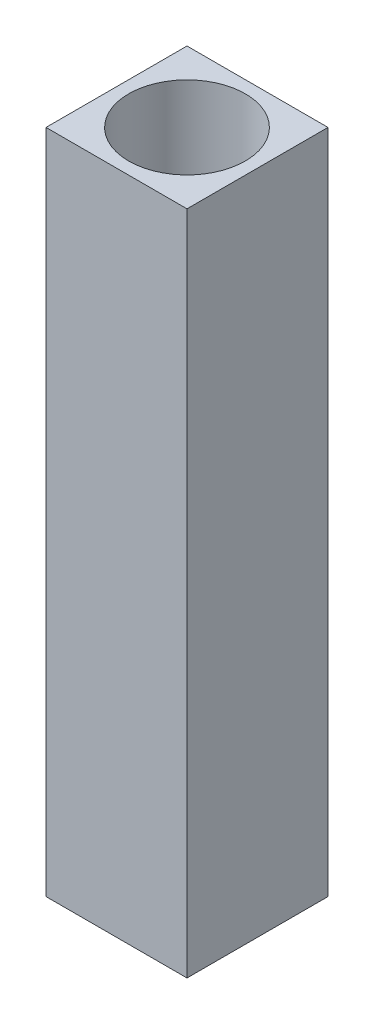
ISO-10303-21;
HEADER;
FILE_DESCRIPTION(('STEP AP214'),'2;1');
FILE_NAME('part.step','',(''),(''),'','','');
FILE_SCHEMA(('AUTOMOTIVE_DESIGN { 1 0 10303 214 1 1 1 1 }'));
ENDSEC;
DATA;
#1=APPLICATION_CONTEXT('core data for automotive mechanical design processes');
#2=APPLICATION_PROTOCOL_DEFINITION('international standard','automotive_design',2000,#1);
#3=PRODUCT_CONTEXT('',#1,'mechanical');
#4=PRODUCT('Part','Part','',(#3));
#5=PRODUCT_RELATED_PRODUCT_CATEGORY('part','',(#4));
#6=PRODUCT_DEFINITION_FORMATION('','',#4);
#7=PRODUCT_DEFINITION_CONTEXT('part definition',#1,'design');
#8=PRODUCT_DEFINITION('design','',#6,#7);
#9=PRODUCT_DEFINITION_SHAPE('','',#8);
#10=(LENGTH_UNIT() NAMED_UNIT(*) SI_UNIT(.MILLI.,.METRE.));
#11=(NAMED_UNIT(*) PLANE_ANGLE_UNIT() SI_UNIT($,.RADIAN.));
#12=(NAMED_UNIT(*) SI_UNIT($,.STERADIAN.) SOLID_ANGLE_UNIT());
#13=UNCERTAINTY_MEASURE_WITH_UNIT(LENGTH_MEASURE(1.E-05),#10,'distance_accuracy_value','');
#14=(GEOMETRIC_REPRESENTATION_CONTEXT(3) GLOBAL_UNCERTAINTY_ASSIGNED_CONTEXT((#13)) GLOBAL_UNIT_ASSIGNED_CONTEXT((#10,
#11,#12)) REPRESENTATION_CONTEXT('',''));
#15=CARTESIAN_POINT('',(0.,0.,0.));
#16=DIRECTION('',(0.,0.,1.));
#17=DIRECTION('',(1.,0.,0.));
#18=AXIS2_PLACEMENT_3D('',#15,#16,#17);
#19=CARTESIAN_POINT('',(-0.635,-4.,-0.635));
#20=DIRECTION('',(0.,0.,-1.));
#21=DIRECTION('',(-1.,0.,0.));
#22=AXIS2_PLACEMENT_3D('',#19,#20,#21);
#23=PLANE('',#22);
#24=DIRECTION('',(-1.,0.,0.));
#25=VECTOR('',#24,1.);
#26=CARTESIAN_POINT('',(-0.635,6.,-0.635));
#27=LINE('',#26,#25);
#28=CARTESIAN_POINT('',(-0.635,6.,-0.635));
#29=VERTEX_POINT('',#28);
#30=CARTESIAN_POINT('',(0.635,6.,-0.635));
#31=VERTEX_POINT('',#30);
#32=EDGE_CURVE('E72',#29,#31,#27,.F.);
#33=ORIENTED_EDGE('',*,*,#32,.T.);
#34=DIRECTION('',(0.,1.,0.));
#35=VECTOR('',#34,1.);
#36=CARTESIAN_POINT('',(0.635,-4.,-0.635));
#37=LINE('',#36,#35);
#38=CARTESIAN_POINT('',(0.635,0.,-0.635));
#39=VERTEX_POINT('',#38);
#40=EDGE_CURVE('E76',#39,#31,#37,.T.);
#41=ORIENTED_EDGE('',*,*,#40,.F.);
#42=DIRECTION('',(-1.,0.,0.));
#43=VECTOR('',#42,1.);
#44=CARTESIAN_POINT('',(-0.635,0.,-0.635));
#45=LINE('',#44,#43);
#46=CARTESIAN_POINT('',(-0.635,0.,-0.635));
#47=VERTEX_POINT('',#46);
#48=EDGE_CURVE('E82',#39,#47,#45,.T.);
#49=ORIENTED_EDGE('',*,*,#48,.T.);
#50=DIRECTION('',(0.,1.,0.));
#51=VECTOR('',#50,1.);
#52=CARTESIAN_POINT('',(-0.635,-4.,-0.635));
#53=LINE('',#52,#51);
#54=EDGE_CURVE('E74',#29,#47,#53,.F.);
#55=ORIENTED_EDGE('',*,*,#54,.F.);
#56=EDGE_LOOP('',(#33,#41,#49,#55));
#57=FACE_BOUND('',#56,.T.);
#58=ADVANCED_FACE('F17',(#57),#23,.T.);
#59=CARTESIAN_POINT('',(-0.635,-4.,0.635));
#60=DIRECTION('',(0.,0.,1.));
#61=DIRECTION('',(1.,0.,0.));
#62=AXIS2_PLACEMENT_3D('',#59,#60,#61);
#63=PLANE('',#62);
#64=DIRECTION('',(1.,0.,0.));
#65=VECTOR('',#64,1.);
#66=CARTESIAN_POINT('',(-0.635,6.,0.635));
#67=LINE('',#66,#65);
#68=CARTESIAN_POINT('',(0.635,6.,0.635));
#69=VERTEX_POINT('',#68);
#70=CARTESIAN_POINT('',(-0.635,6.,0.635));
#71=VERTEX_POINT('',#70);
#72=EDGE_CURVE('E33',#69,#71,#67,.F.);
#73=ORIENTED_EDGE('',*,*,#72,.T.);
#74=DIRECTION('',(0.,1.,0.));
#75=VECTOR('',#74,1.);
#76=CARTESIAN_POINT('',(-0.635,-4.,0.635));
#77=LINE('',#76,#75);
#78=CARTESIAN_POINT('',(-0.635,0.,0.635));
#79=VERTEX_POINT('',#78);
#80=EDGE_CURVE('E59',#79,#71,#77,.T.);
#81=ORIENTED_EDGE('',*,*,#80,.F.);
#82=DIRECTION('',(1.,0.,0.));
#83=VECTOR('',#82,1.);
#84=CARTESIAN_POINT('',(-0.635,0.,0.635));
#85=LINE('',#84,#83);
#86=CARTESIAN_POINT('',(0.635,0.,0.635));
#87=VERTEX_POINT('',#86);
#88=EDGE_CURVE('E64',#79,#87,#85,.T.);
#89=ORIENTED_EDGE('',*,*,#88,.T.);
#90=DIRECTION('',(0.,1.,0.));
#91=VECTOR('',#90,1.);
#92=CARTESIAN_POINT('',(0.635,-4.,0.635));
#93=LINE('',#92,#91);
#94=EDGE_CURVE('E62',#69,#87,#93,.F.);
#95=ORIENTED_EDGE('',*,*,#94,.F.);
#96=EDGE_LOOP('',(#73,#81,#89,#95));
#97=FACE_BOUND('',#96,.T.);
#98=ADVANCED_FACE('F58',(#97),#63,.T.);
#99=CARTESIAN_POINT('',(-0.635,-4.,-0.635));
#100=DIRECTION('',(-1.,0.,0.));
#101=DIRECTION('',(0.,0.,1.));
#102=AXIS2_PLACEMENT_3D('',#99,#100,#101);
#103=PLANE('',#102);
#104=DIRECTION('',(0.,0.,1.));
#105=VECTOR('',#104,1.);
#106=CARTESIAN_POINT('',(-0.635,6.,-0.635));
#107=LINE('',#106,#105);
#108=EDGE_CURVE('E54',#71,#29,#107,.F.);
#109=ORIENTED_EDGE('',*,*,#108,.T.);
#110=ORIENTED_EDGE('',*,*,#54,.T.);
#111=DIRECTION('',(0.,0.,1.));
#112=VECTOR('',#111,1.);
#113=CARTESIAN_POINT('',(-0.635,0.,1.385));
#114=LINE('',#113,#112);
#115=EDGE_CURVE('E68',#47,#79,#114,.T.);
#116=ORIENTED_EDGE('',*,*,#115,.T.);
#117=ORIENTED_EDGE('',*,*,#80,.T.);
#118=EDGE_LOOP('',(#109,#110,#116,#117));
#119=FACE_BOUND('',#118,.T.);
#120=ADVANCED_FACE('F66',(#119),#103,.T.);
#121=CARTESIAN_POINT('',(0.635,-4.,-0.635));
#122=DIRECTION('',(1.,0.,0.));
#123=DIRECTION('',(0.,0.,-1.));
#124=AXIS2_PLACEMENT_3D('',#121,#122,#123);
#125=PLANE('',#124);
#126=DIRECTION('',(0.,0.,1.));
#127=VECTOR('',#126,1.);
#128=CARTESIAN_POINT('',(0.635,6.,1.385));
#129=LINE('',#128,#127);
#130=EDGE_CURVE('E91',#69,#31,#129,.F.);
#131=ORIENTED_EDGE('',*,*,#130,.F.);
#132=ORIENTED_EDGE('',*,*,#94,.T.);
#133=DIRECTION('',(0.,0.,1.));
#134=VECTOR('',#133,1.);
#135=CARTESIAN_POINT('',(0.635,0.,1.385));
#136=LINE('',#135,#134);
#137=EDGE_CURVE('E92',#87,#39,#136,.F.);
#138=ORIENTED_EDGE('',*,*,#137,.T.);
#139=ORIENTED_EDGE('',*,*,#40,.T.);
#140=EDGE_LOOP('',(#131,#132,#138,#139));
#141=FACE_BOUND('',#140,.T.);
#142=ADVANCED_FACE('F98',(#141),#125,.T.);
#143=CARTESIAN_POINT('',(1.385,0.,1.385));
#144=DIRECTION('',(0.,1.,0.));
#145=DIRECTION('',(0.,0.,1.));
#146=AXIS2_PLACEMENT_3D('',#143,#144,#145);
#147=PLANE('',#146);
#148=ORIENTED_EDGE('',*,*,#48,.F.);
#149=ORIENTED_EDGE('',*,*,#137,.F.);
#150=ORIENTED_EDGE('',*,*,#88,.F.);
#151=ORIENTED_EDGE('',*,*,#115,.F.);
#152=EDGE_LOOP('',(#148,#149,#150,#151));
#153=FACE_BOUND('',#152,.T.);
#154=CARTESIAN_POINT('',(0.,0.,0.));
#155=DIRECTION('',(0.,1.,0.));
#156=DIRECTION('',(0.,0.,1.));
#157=AXIS2_PLACEMENT_3D('',#154,#155,#156);
#158=CIRCLE('',#157,0.525);
#159=CARTESIAN_POINT('',(0.,0.,0.525));
#160=VERTEX_POINT('',#159);
#161=EDGE_CURVE('E20',#160,#160,#158,.T.);
#162=ORIENTED_EDGE('',*,*,#161,.T.);
#163=EDGE_LOOP('',(#162));
#164=FACE_BOUND('',#163,.T.);
#165=ADVANCED_FACE('F89',(#153,#164),#147,.F.);
#166=CARTESIAN_POINT('',(1.385,6.,1.385));
#167=DIRECTION('',(0.,1.,0.));
#168=DIRECTION('',(0.,0.,1.));
#169=AXIS2_PLACEMENT_3D('',#166,#167,#168);
#170=PLANE('',#169);
#171=ORIENTED_EDGE('',*,*,#72,.F.);
#172=ORIENTED_EDGE('',*,*,#130,.T.);
#173=ORIENTED_EDGE('',*,*,#32,.F.);
#174=ORIENTED_EDGE('',*,*,#108,.F.);
#175=EDGE_LOOP('',(#171,#172,#173,#174));
#176=FACE_BOUND('',#175,.T.);
#177=CARTESIAN_POINT('',(0.,6.,0.));
#178=DIRECTION('',(0.,1.,0.));
#179=DIRECTION('',(0.,0.,1.));
#180=AXIS2_PLACEMENT_3D('',#177,#178,#179);
#181=CIRCLE('',#180,0.525);
#182=CARTESIAN_POINT('',(0.,6.,0.525));
#183=VERTEX_POINT('',#182);
#184=EDGE_CURVE('E11',#183,#183,#181,.F.);
#185=ORIENTED_EDGE('',*,*,#184,.T.);
#186=EDGE_LOOP('',(#185));
#187=FACE_BOUND('',#186,.T.);
#188=ADVANCED_FACE('F70',(#176,#187),#170,.T.);
#189=CARTESIAN_POINT('',(0.,0.,0.));
#190=DIRECTION('',(0.,1.,0.));
#191=DIRECTION('',(0.,0.,1.));
#192=AXIS2_PLACEMENT_3D('',#189,#190,#191);
#193=CYLINDRICAL_SURFACE('',#192,0.525);
#194=ORIENTED_EDGE('',*,*,#184,.F.);
#195=EDGE_LOOP('',(#194));
#196=FACE_BOUND('',#195,.T.);
#197=ORIENTED_EDGE('',*,*,#161,.F.);
#198=EDGE_LOOP('',(#197));
#199=FACE_BOUND('',#198,.T.);
#200=ADVANCED_FACE('F108',(#196,#199),#193,.F.);
#201=CLOSED_SHELL('',(#58,#98,#120,#142,#165,#188,#200));
#202=MANIFOLD_SOLID_BREP('B1',#201);
#203=ADVANCED_BREP_SHAPE_REPRESENTATION('',(#18,#202),#14);
#204=SHAPE_DEFINITION_REPRESENTATION(#9,#203);
ENDSEC;
END-ISO-10303-21;
